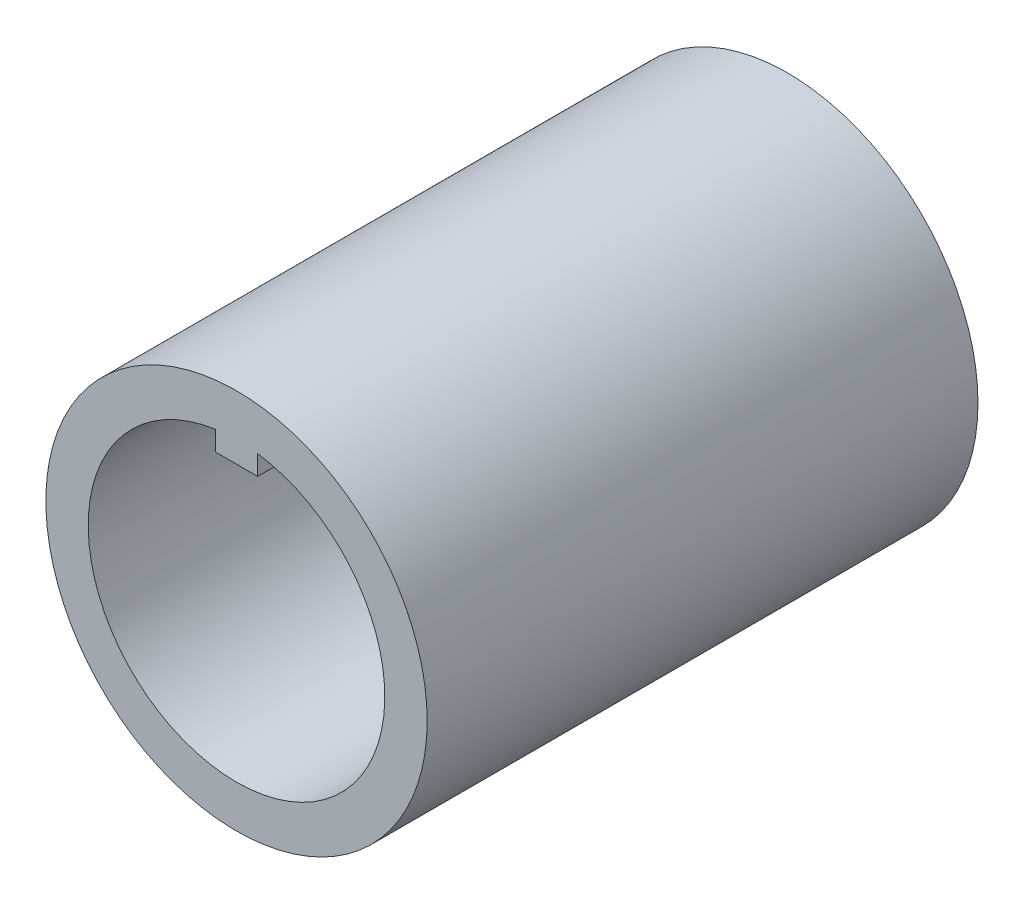
ISO-10303-21;
HEADER;
FILE_DESCRIPTION(('STEP AP214'),'2;1');
FILE_NAME('part.step','',(''),(''),'','','');
FILE_SCHEMA(('AUTOMOTIVE_DESIGN { 1 0 10303 214 1 1 1 1 }'));
ENDSEC;
DATA;
#1=APPLICATION_CONTEXT('core data for automotive mechanical design processes');
#2=APPLICATION_PROTOCOL_DEFINITION('international standard','automotive_design',2000,#1);
#3=PRODUCT_CONTEXT('',#1,'mechanical');
#4=PRODUCT('Part','Part','',(#3));
#5=PRODUCT_RELATED_PRODUCT_CATEGORY('part','',(#4));
#6=PRODUCT_DEFINITION_FORMATION('','',#4);
#7=PRODUCT_DEFINITION_CONTEXT('part definition',#1,'design');
#8=PRODUCT_DEFINITION('design','',#6,#7);
#9=PRODUCT_DEFINITION_SHAPE('','',#8);
#10=(LENGTH_UNIT() NAMED_UNIT(*) SI_UNIT(.MILLI.,.METRE.));
#11=(NAMED_UNIT(*) PLANE_ANGLE_UNIT() SI_UNIT($,.RADIAN.));
#12=(NAMED_UNIT(*) SI_UNIT($,.STERADIAN.) SOLID_ANGLE_UNIT());
#13=UNCERTAINTY_MEASURE_WITH_UNIT(LENGTH_MEASURE(1.E-05),#10,'distance_accuracy_value','');
#14=(GEOMETRIC_REPRESENTATION_CONTEXT(3) GLOBAL_UNCERTAINTY_ASSIGNED_CONTEXT((#13)) GLOBAL_UNIT_ASSIGNED_CONTEXT((#10,
#11,#12)) REPRESENTATION_CONTEXT('',''));
#15=CARTESIAN_POINT('',(0.,0.,0.));
#16=DIRECTION('',(0.,0.,1.));
#17=DIRECTION('',(1.,0.,0.));
#18=AXIS2_PLACEMENT_3D('',#15,#16,#17);
#19=CARTESIAN_POINT('',(0.,0.,-26.));
#20=DIRECTION('',(0.,0.,1.));
#21=DIRECTION('',(-1.,0.,0.));
#22=AXIS2_PLACEMENT_3D('',#19,#20,#21);
#23=CYLINDRICAL_SURFACE('',#22,7.);
#24=CARTESIAN_POINT('',(0.,-7.,-17.));
#25=CARTESIAN_POINT('',(0.160281740269091,-6.9999940839629,-16.9999925304185));
#26=CARTESIAN_POINT('',(0.320833907522427,-6.99443250051265,-16.9870786839034));
#27=CARTESIAN_POINT('',(0.637349314958982,-6.97273920628719,-16.9359176345736));
#28=CARTESIAN_POINT('',(0.793299928144207,-6.95658080950724,-16.8976064709267));
#29=CARTESIAN_POINT('',(1.0955347051483,-6.91541630739345,-16.7973302363749));
#30=CARTESIAN_POINT('',(1.24185033642246,-6.89044089228941,-16.7354471561946));
#31=CARTESIAN_POINT('',(1.5218733278968,-6.83405660276648,-16.5901355814363));
#32=CARTESIAN_POINT('',(1.6555840905338,-6.80264947176647,-16.5067129239082));
#33=CARTESIAN_POINT('',(1.91384144205638,-6.7346782187555,-16.3160723523121));
#34=CARTESIAN_POINT('',(2.03764045493602,-6.69793895962371,-16.2079047401042));
#35=CARTESIAN_POINT('',(2.26599040232609,-6.62417654338771,-15.9728561314992));
#36=CARTESIAN_POINT('',(2.3705306503261,-6.5871532404671,-15.8459648153973));
#37=CARTESIAN_POINT('',(2.56285686126493,-6.51482055271223,-15.5689672772845));
#38=CARTESIAN_POINT('',(2.64946811752635,-6.47970460244925,-15.4179895419707));
#39=CARTESIAN_POINT('',(2.795731994081,-6.41796168635027,-15.101890571811));
#40=CARTESIAN_POINT('',(2.8553992914263,-6.39133010120133,-14.9367770955138));
#41=CARTESIAN_POINT('',(2.94294919918375,-6.35147799087276,-14.6056992616908));
#42=CARTESIAN_POINT('',(2.97227494401777,-6.3376522143554,-14.4401922982206));
#43=CARTESIAN_POINT('',(3.00280607158394,-6.32324849688131,-14.1060740303897));
#44=CARTESIAN_POINT('',(3.00402828615096,-6.32266262625149,-13.9374646447086));
#45=CARTESIAN_POINT('',(2.97939999510613,-6.33429573902539,-13.6167000962815));
#46=CARTESIAN_POINT('',(2.95576113815072,-6.34546870930157,-13.464329376668));
#47=CARTESIAN_POINT('',(2.88580772808799,-6.37758411517576,-13.1659724140987));
#48=CARTESIAN_POINT('',(2.83948852833539,-6.39852855266592,-13.0199874861139));
#49=CARTESIAN_POINT('',(2.7245765907069,-6.44830685655466,-12.7347528485648));
#50=CARTESIAN_POINT('',(2.65551974428426,-6.47730295111391,-12.5957197057819));
#51=CARTESIAN_POINT('',(2.49742304873013,-6.53988493882129,-12.3306536759306));
#52=CARTESIAN_POINT('',(2.40837507480489,-6.57347269593628,-12.2046261050705));
#53=CARTESIAN_POINT('',(2.20343405392229,-6.64512404535213,-11.9572224963786));
#54=CARTESIAN_POINT('',(2.08584728856133,-6.68331855389209,-11.837283270528));
#55=CARTESIAN_POINT('',(1.83187332405076,-6.75734605758523,-11.6183284093441));
#56=CARTESIAN_POINT('',(1.6954812162799,-6.79317843254652,-11.5193182541218));
#57=CARTESIAN_POINT('',(1.40318582301271,-6.8595969368957,-11.342756067193));
#58=CARTESIAN_POINT('',(1.24687114970231,-6.89002455033727,-11.2658209812944));
#59=CARTESIAN_POINT('',(0.921879694158934,-6.94097396260558,-11.1398497623853));
#60=CARTESIAN_POINT('',(0.753210215657664,-6.9615015603998,-11.0907972940223));
#61=CARTESIAN_POINT('',(0.42027623894137,-6.98923526893385,-11.025066139541));
#62=CARTESIAN_POINT('',(0.256457961010924,-6.99723249964589,-11.0064612346856));
#63=CARTESIAN_POINT('',(-0.0721433011185075,-7.00155416651738,-10.9963704235918));
#64=CARTESIAN_POINT('',(-0.236925971900557,-6.99788220531666,-11.0048761474676));
#65=CARTESIAN_POINT('',(-0.553542439626671,-6.9797867632015,-11.0474156320548));
#66=CARTESIAN_POINT('',(-0.705598931504216,-6.96594519473644,-11.0800683214483));
#67=CARTESIAN_POINT('',(-1.00189113639242,-6.92953888009974,-11.1680208942382));
#68=CARTESIAN_POINT('',(-1.14612587370002,-6.90697304848521,-11.2233235957222));
#69=CARTESIAN_POINT('',(-1.42777696523888,-6.85438751513719,-11.3568011595021));
#70=CARTESIAN_POINT('',(-1.56483974951837,-6.82415705388474,-11.4356363302261));
#71=CARTESIAN_POINT('',(-1.82428490564705,-6.75942988391438,-11.6132189444759));
#72=CARTESIAN_POINT('',(-1.94666097512992,-6.72493135648758,-11.7119748880233));
#73=CARTESIAN_POINT('',(-2.18296759532595,-6.65214788697903,-11.9352895878429));
#74=CARTESIAN_POINT('',(-2.29556617553686,-6.61377354998591,-12.0612322100614));
#75=CARTESIAN_POINT('',(-2.49843431443676,-6.53984037690252,-12.3307822986316));
#76=CARTESIAN_POINT('',(-2.58869766421195,-6.50428232556792,-12.4743946603748));
#77=CARTESIAN_POINT('',(-2.74563875632303,-6.43962969285319,-12.7788138529586));
#78=CARTESIAN_POINT('',(-2.81186415020233,-6.41066255987443,-12.93988300905));
#79=CARTESIAN_POINT('',(-2.91565885028324,-6.36413607530145,-13.2725263267395));
#80=CARTESIAN_POINT('',(-2.95325364225748,-6.346566580073,-13.4440909983246));
#81=CARTESIAN_POINT('',(-2.9961194841997,-6.32643481136621,-13.7779911723329));
#82=CARTESIAN_POINT('',(-3.00374693238451,-6.3227792566546,-13.9399592675106));
#83=CARTESIAN_POINT('',(-2.99282649265778,-6.32795618271386,-14.2627897469115));
#84=CARTESIAN_POINT('',(-2.97428322126543,-6.33678646098226,-14.4236523211193));
#85=CARTESIAN_POINT('',(-2.91356431394149,-6.36491653890771,-14.7310416962733));
#86=CARTESIAN_POINT('',(-2.87266975661121,-6.38364713099396,-14.8778787915707));
#87=CARTESIAN_POINT('',(-2.769702223632,-6.42898875831973,-15.1626207660839));
#88=CARTESIAN_POINT('',(-2.70762322652259,-6.45560203384716,-15.3005230924077));
#89=CARTESIAN_POINT('',(-2.55963250501149,-6.5157524732596,-15.5728207086796));
#90=CARTESIAN_POINT('',(-2.47248232196069,-6.5496164957701,-15.7064691536948));
#91=CARTESIAN_POINT('',(-2.2784960092513,-6.61959778926566,-15.9579823612475));
#92=CARTESIAN_POINT('',(-2.17165243666714,-6.6557159087398,-16.0758411270492));
#93=CARTESIAN_POINT('',(-1.93135048700133,-6.72955424641834,-16.3020036355007));
#94=CARTESIAN_POINT('',(-1.79645724733279,-6.76717599448736,-16.4088195655728));
#95=CARTESIAN_POINT('',(-1.50919760355001,-6.83696477009089,-16.5984397600312));
#96=CARTESIAN_POINT('',(-1.35682332068822,-6.86912932173672,-16.6812331375999));
#97=CARTESIAN_POINT('',(-1.11954532843042,-6.91035442086787,-16.7845926909895));
#98=CARTESIAN_POINT('',(-1.03957288024831,-6.92286397965452,-16.8154332908018));
#99=CARTESIAN_POINT('',(-0.876970802782695,-6.94533202163241,-16.8702382020223));
#100=CARTESIAN_POINT('',(-0.794342461515166,-6.95529172101821,-16.8942057922754));
#101=CARTESIAN_POINT('',(-0.627265567421398,-6.97234378079151,-16.9349477172834));
#102=CARTESIAN_POINT('',(-0.542821986677287,-6.97944312738119,-16.9517395843805));
#103=CARTESIAN_POINT('',(-0.372647906839315,-6.99059319635284,-16.9780087142034));
#104=CARTESIAN_POINT('',(-0.286918376030205,-6.99464610559385,-16.9874912240139));
#105=CARTESIAN_POINT('',(-0.167492669563777,-6.99807592564236,-16.9955082749436));
#106=CARTESIAN_POINT('',(-0.134021137958668,-6.99879677015532,-16.9971918541176));
#107=CARTESIAN_POINT('',(-0.0670370145842123,-6.99975942751561,-16.9994385012841));
#108=CARTESIAN_POINT('',(-0.0335244225617064,-7.0000012373944,-17.0000015623327));
#109=CARTESIAN_POINT('',(0.,-7.,-17.));
#110=B_SPLINE_CURVE_WITH_KNOTS('',3,(#24,#25,#26,#27,#28,#29,#30,#31,#32,#33,#34,#35,#36,#37,
#38,#39,#40,#41,#42,#43,#44,#45,#46,#47,#48,#49,#50,#51,#52,#53,#54,#55,#56,#57,#58,#59,#60,#61,
#62,#63,#64,#65,#66,#67,#68,#69,#70,#71,#72,#73,#74,#75,#76,#77,#78,#79,#80,#81,#82,#83,#84,#85,
#86,#87,#88,#89,#90,#91,#92,#93,#94,#95,#96,#97,#98,#99,#100,#101,#102,#103,#104,#105,#106,#107,
#108,#109),.UNSPECIFIED.,.T.,.F.,(4,2,2,2,2,2,2,2,2,2,2,2,2,2,2,2,2,2,2,2,2,2,2,2,2,2,2,2,2,2,2,
2,2,2,2,2,2,2,2,2,2,2,4),(0.,0.480714322748847,0.962643903423341,1.44291226275142,
1.92305060961533,2.42622743558506,2.92968263421741,3.45969560860061,3.98941952228263,
4.492594268281,4.99546764377915,5.45710720323576,5.91884138089948,6.3906540887232,
6.86265889892286,7.37709837725841,7.89167239108963,8.41947244601234,8.94696296364743,
9.43957347502028,9.93203191709569,10.3983119423363,10.8646499992176,11.3455505516221,
11.8266567358409,12.3440285038672,12.8615439335848,13.3883469079738,13.9146803943342,
14.3986848887267,14.882604015318,15.341320451094,15.8001673810816,16.2874475008663,
16.7749121624767,17.3008416934144,17.8270092002163,18.0865840789243,18.3460349177801,
18.6048481685098,18.8634754544625,18.964020720529,19.0645666096629),.UNSPECIFIED.);
#111=CARTESIAN_POINT('',(0.,-7.,-17.));
#112=VERTEX_POINT('',#111);
#113=EDGE_CURVE('E134',#112,#112,#110,.T.);
#114=ORIENTED_EDGE('',*,*,#113,.T.);
#115=EDGE_LOOP('',(#114));
#116=FACE_BOUND('',#115,.T.);
#117=CARTESIAN_POINT('',(0.,0.,0.));
#118=DIRECTION('',(0.,0.,1.));
#119=DIRECTION('',(1.,0.,0.));
#120=AXIS2_PLACEMENT_3D('',#117,#118,#119);
#121=CIRCLE('',#120,7.);
#122=CARTESIAN_POINT('',(-1.,6.92820323027551,0.));
#123=VERTEX_POINT('',#122);
#124=CARTESIAN_POINT('',(1.,6.92820323027551,0.));
#125=VERTEX_POINT('',#124);
#126=EDGE_CURVE('E129',#123,#125,#121,.T.);
#127=ORIENTED_EDGE('',*,*,#126,.T.);
#128=DIRECTION('',(0.,0.,1.));
#129=VECTOR('',#128,1.);
#130=CARTESIAN_POINT('',(1.,6.92820323027551,-26.));
#131=LINE('',#130,#129);
#132=CARTESIAN_POINT('',(1.,6.92820323027551,-26.));
#133=VERTEX_POINT('',#132);
#134=EDGE_CURVE('E128',#133,#125,#131,.T.);
#135=ORIENTED_EDGE('',*,*,#134,.F.);
#136=CARTESIAN_POINT('',(0.,0.,-26.));
#137=DIRECTION('',(0.,0.,1.));
#138=DIRECTION('',(1.,0.,0.));
#139=AXIS2_PLACEMENT_3D('',#136,#137,#138);
#140=CIRCLE('',#139,7.);
#141=CARTESIAN_POINT('',(-1.,6.92820323027551,-26.));
#142=VERTEX_POINT('',#141);
#143=EDGE_CURVE('E115',#142,#133,#140,.T.);
#144=ORIENTED_EDGE('',*,*,#143,.F.);
#145=DIRECTION('',(0.,0.,1.));
#146=VECTOR('',#145,1.);
#147=CARTESIAN_POINT('',(-1.,6.92820323027551,-26.));
#148=LINE('',#147,#146);
#149=EDGE_CURVE('E11',#142,#123,#148,.T.);
#150=ORIENTED_EDGE('',*,*,#149,.T.);
#151=EDGE_LOOP('',(#127,#135,#144,#150));
#152=FACE_BOUND('',#151,.T.);
#153=ADVANCED_FACE('F45',(#116,#152),#23,.F.);
#154=CARTESIAN_POINT('',(-1.,0.,-26.));
#155=DIRECTION('',(1.,0.,0.));
#156=DIRECTION('',(0.,0.,1.));
#157=AXIS2_PLACEMENT_3D('',#154,#155,#156);
#158=PLANE('',#157);
#159=DIRECTION('',(0.,-1.,0.));
#160=VECTOR('',#159,1.);
#161=CARTESIAN_POINT('',(-1.,0.,0.));
#162=LINE('',#161,#160);
#163=CARTESIAN_POINT('',(-1.,6.,0.));
#164=VERTEX_POINT('',#163);
#165=EDGE_CURVE('E133',#123,#164,#162,.T.);
#166=ORIENTED_EDGE('',*,*,#165,.F.);
#167=ORIENTED_EDGE('',*,*,#149,.F.);
#168=DIRECTION('',(0.,-1.,0.));
#169=VECTOR('',#168,1.);
#170=CARTESIAN_POINT('',(-1.,0.,-26.));
#171=LINE('',#170,#169);
#172=CARTESIAN_POINT('',(-1.,6.,-26.));
#173=VERTEX_POINT('',#172);
#174=EDGE_CURVE('E94',#142,#173,#171,.T.);
#175=ORIENTED_EDGE('',*,*,#174,.T.);
#176=DIRECTION('',(0.,0.,1.));
#177=VECTOR('',#176,1.);
#178=CARTESIAN_POINT('',(-1.,6.,-26.));
#179=LINE('',#178,#177);
#180=EDGE_CURVE('E61',#173,#164,#179,.T.);
#181=ORIENTED_EDGE('',*,*,#180,.T.);
#182=EDGE_LOOP('',(#166,#167,#175,#181));
#183=FACE_BOUND('',#182,.T.);
#184=ADVANCED_FACE('F112',(#183),#158,.F.);
#185=CARTESIAN_POINT('',(0.,6.,-26.));
#186=DIRECTION('',(0.,1.,0.));
#187=DIRECTION('',(0.,0.,-1.));
#188=AXIS2_PLACEMENT_3D('',#185,#186,#187);
#189=PLANE('',#188);
#190=DIRECTION('',(1.,0.,0.));
#191=VECTOR('',#190,1.);
#192=CARTESIAN_POINT('',(0.,6.,0.));
#193=LINE('',#192,#191);
#194=CARTESIAN_POINT('',(1.,6.,0.));
#195=VERTEX_POINT('',#194);
#196=EDGE_CURVE('E106',#164,#195,#193,.T.);
#197=ORIENTED_EDGE('',*,*,#196,.F.);
#198=ORIENTED_EDGE('',*,*,#180,.F.);
#199=DIRECTION('',(1.,0.,0.));
#200=VECTOR('',#199,1.);
#201=CARTESIAN_POINT('',(0.,6.,-26.));
#202=LINE('',#201,#200);
#203=CARTESIAN_POINT('',(1.,6.,-26.));
#204=VERTEX_POINT('',#203);
#205=EDGE_CURVE('E97',#173,#204,#202,.T.);
#206=ORIENTED_EDGE('',*,*,#205,.T.);
#207=DIRECTION('',(0.,0.,1.));
#208=VECTOR('',#207,1.);
#209=CARTESIAN_POINT('',(1.,6.,-26.));
#210=LINE('',#209,#208);
#211=EDGE_CURVE('E110',#204,#195,#210,.T.);
#212=ORIENTED_EDGE('',*,*,#211,.T.);
#213=EDGE_LOOP('',(#197,#198,#206,#212));
#214=FACE_BOUND('',#213,.T.);
#215=ADVANCED_FACE('F105',(#214),#189,.F.);
#216=CARTESIAN_POINT('',(1.,0.,-26.));
#217=DIRECTION('',(-1.,0.,0.));
#218=DIRECTION('',(0.,0.,-1.));
#219=AXIS2_PLACEMENT_3D('',#216,#217,#218);
#220=PLANE('',#219);
#221=DIRECTION('',(0.,1.,0.));
#222=VECTOR('',#221,1.);
#223=CARTESIAN_POINT('',(1.,0.,0.));
#224=LINE('',#223,#222);
#225=EDGE_CURVE('E83',#195,#125,#224,.T.);
#226=ORIENTED_EDGE('',*,*,#225,.F.);
#227=ORIENTED_EDGE('',*,*,#211,.F.);
#228=DIRECTION('',(0.,1.,0.));
#229=VECTOR('',#228,1.);
#230=CARTESIAN_POINT('',(1.,0.,-26.));
#231=LINE('',#230,#229);
#232=EDGE_CURVE('E69',#204,#133,#231,.T.);
#233=ORIENTED_EDGE('',*,*,#232,.T.);
#234=ORIENTED_EDGE('',*,*,#134,.T.);
#235=EDGE_LOOP('',(#226,#227,#233,#234));
#236=FACE_BOUND('',#235,.T.);
#237=ADVANCED_FACE('F151',(#236),#220,.F.);
#238=CARTESIAN_POINT('',(0.,0.,-26.));
#239=DIRECTION('',(0.,0.,1.));
#240=DIRECTION('',(-1.,0.,0.));
#241=AXIS2_PLACEMENT_3D('',#238,#239,#240);
#242=CYLINDRICAL_SURFACE('',#241,9.);
#243=CARTESIAN_POINT('',(0.,-9.,-17.));
#244=CARTESIAN_POINT('',(0.163690088660169,-9.00000045902832,-17.0000007611949));
#245=CARTESIAN_POINT('',(0.327375583615649,-8.99549308522634,-16.9865592016183));
#246=CARTESIAN_POINT('',(0.649925282618916,-8.97795630609842,-16.9333126735483));
#247=CARTESIAN_POINT('',(0.808788984356454,-8.96492601606458,-16.8935049681532));
#248=CARTESIAN_POINT('',(1.11699836850533,-8.93175923719328,-16.7890422698479));
#249=CARTESIAN_POINT('',(1.2663594776581,-8.9116346319256,-16.7244288126222));
#250=CARTESIAN_POINT('',(1.55212481041597,-8.86633337152025,-16.572376481485));
#251=CARTESIAN_POINT('',(1.68852647087612,-8.84115572003333,-16.4849331049922));
#252=CARTESIAN_POINT('',(1.9492250250668,-8.78742283329015,-16.2865225854237));
#253=CARTESIAN_POINT('',(2.07301110089493,-8.75878669391354,-16.1749062972185));
#254=CARTESIAN_POINT('',(2.30049807810626,-8.70180944349364,-15.9326985358803));
#255=CARTESIAN_POINT('',(2.40419455646839,-8.67346839871647,-15.8021028952145));
#256=CARTESIAN_POINT('',(2.59147482668358,-8.61939997431822,-15.5210446544106));
#257=CARTESIAN_POINT('',(2.6743945746631,-8.59377117827064,-15.3701187808036));
#258=CARTESIAN_POINT('',(2.81345662163316,-8.54925916255803,-15.0554717166244));
#259=CARTESIAN_POINT('',(2.86960709216029,-8.53037388482237,-14.8917544485118));
#260=CARTESIAN_POINT('',(2.95162038452749,-8.50233909808132,-14.5619803355099));
#261=CARTESIAN_POINT('',(2.97844034481531,-8.49288287308834,-14.3961883745328));
#262=CARTESIAN_POINT('',(3.00402337000343,-8.48386969888523,-14.0622087375324));
#263=CARTESIAN_POINT('',(3.00279510481415,-8.4843096906819,-13.8940218178724));
#264=CARTESIAN_POINT('',(2.97305971111025,-8.49477045024541,-13.5681901086679));
#265=CARTESIAN_POINT('',(2.94580173950098,-8.50435247602599,-13.4104147912429));
#266=CARTESIAN_POINT('',(2.86681848854825,-8.53129973173653,-13.1018197411795));
#267=CARTESIAN_POINT('',(2.81509027977561,-8.54866589352322,-12.9510008436948));
#268=CARTESIAN_POINT('',(2.68781717418063,-8.58953733393746,-12.6577617512256));
#269=CARTESIAN_POINT('',(2.61190214612179,-8.61313697379352,-12.5155159235914));
#270=CARTESIAN_POINT('',(2.43866731890942,-8.66377675727179,-12.2453872751608));
#271=CARTESIAN_POINT('',(2.34134133709201,-8.6908178937139,-12.1175086191999));
#272=CARTESIAN_POINT('',(2.12204799804671,-8.74701987503222,-11.8727252055177));
#273=CARTESIAN_POINT('',(1.99905945022893,-8.77621768064528,-11.7567419164728));
#274=CARTESIAN_POINT('',(1.73501870991019,-8.8322081516111,-11.5468062000098));
#275=CARTESIAN_POINT('',(1.59396478698244,-8.85900058614202,-11.4528558855065));
#276=CARTESIAN_POINT('',(1.2958428391388,-8.90751323813381,-11.2889110992948));
#277=CARTESIAN_POINT('',(1.138629829249,-8.92918050024118,-11.2191635259778));
#278=CARTESIAN_POINT('',(0.813807250093517,-8.96461701433304,-11.1073904781329));
#279=CARTESIAN_POINT('',(0.646201314464859,-8.97838900964638,-11.0653553737297));
#280=CARTESIAN_POINT('',(0.313151488587912,-8.99602881214321,-11.0118330019329));
#281=CARTESIAN_POINT('',(0.147928799594537,-9.00030005501184,-10.9991005724817));
#282=CARTESIAN_POINT('',(-0.182325209880714,-8.99966708084482,-11.0009980207954));
#283=CARTESIAN_POINT('',(-0.347356557958953,-8.99476441258087,-11.0156232799396));
#284=CARTESIAN_POINT('',(-0.667559598912768,-8.97660074151313,-11.0708357232079));
#285=CARTESIAN_POINT('',(-0.822878420504531,-8.96358596133577,-11.1106586181485));
#286=CARTESIAN_POINT('',(-1.12456787573872,-8.9307554049021,-11.2141803334002));
#287=CARTESIAN_POINT('',(-1.27093736552582,-8.91093876140025,-11.2778821984034));
#288=CARTESIAN_POINT('',(-1.55486488917982,-8.86586793861869,-11.4292112955224));
#289=CARTESIAN_POINT('',(-1.69208987765144,-8.84048444267358,-11.5174237798495));
#290=CARTESIAN_POINT('',(-1.95019449040676,-8.78715761748787,-11.7145824500405));
#291=CARTESIAN_POINT('',(-2.07106910338673,-8.75921350781483,-11.8235349680953));
#292=CARTESIAN_POINT('',(-2.2987575234189,-8.70230543941334,-12.0649362530198));
#293=CARTESIAN_POINT('',(-2.40468290773731,-8.67335283262283,-12.1982276807806));
#294=CARTESIAN_POINT('',(-2.59277256697072,-8.61899919884126,-12.4813147034327));
#295=CARTESIAN_POINT('',(-2.67493664379304,-8.59359820146007,-12.6311104359022));
#296=CARTESIAN_POINT('',(-2.81279079124908,-8.54947175374151,-12.9430190458697));
#297=CARTESIAN_POINT('',(-2.86853439649506,-8.53073282378936,-13.1051062375063));
#298=CARTESIAN_POINT('',(-2.95168400027807,-8.50232496919348,-13.4371359501324));
#299=CARTESIAN_POINT('',(-2.97910276486182,-8.49265195870918,-13.607074896213));
#300=CARTESIAN_POINT('',(-3.00382884743203,-8.48393576622532,-13.9405912881227));
#301=CARTESIAN_POINT('',(-3.0026107719252,-8.48437200772245,-14.1040470208605));
#302=CARTESIAN_POINT('',(-2.97372688034608,-8.49453809471602,-14.4282952247662));
#303=CARTESIAN_POINT('',(-2.94606263837576,-8.50426738708084,-14.5890878538653));
#304=CARTESIAN_POINT('',(-2.86611543938804,-8.53153572914675,-14.9004069890074));
#305=CARTESIAN_POINT('',(-2.81431003804655,-8.54892294067433,-15.0510704750135));
#306=CARTESIAN_POINT('',(-2.68793809727924,-8.58949196455406,-15.3416822208148));
#307=CARTESIAN_POINT('',(-2.61336650566142,-8.61267506290179,-15.481628093564));
#308=CARTESIAN_POINT('',(-2.43978207775029,-8.66348487678138,-15.7534510097687));
#309=CARTESIAN_POINT('',(-2.33984472829374,-8.69126134926411,-15.8847095056952));
#310=CARTESIAN_POINT('',(-2.11992864940694,-8.74750068849758,-16.1290694401526));
#311=CARTESIAN_POINT('',(-1.99994425335445,-8.77596374737117,-16.2421657270642));
#312=CARTESIAN_POINT('',(-1.73772467076206,-8.83170091576632,-16.4514332368676));
#313=CARTESIAN_POINT('',(-1.59480454049918,-8.8588854540377,-16.546773043253));
#314=CARTESIAN_POINT('',(-1.29407207221987,-8.90777973517836,-16.7119712865519));
#315=CARTESIAN_POINT('',(-1.13626355439704,-8.9294908772379,-16.7818362377661));
#316=CARTESIAN_POINT('',(-0.817480941602926,-8.96416545205626,-16.891164897466));
#317=CARTESIAN_POINT('',(-0.656963273029224,-8.97747637267568,-16.9318473987901));
#318=CARTESIAN_POINT('',(-0.330961248030739,-8.99539221192665,-16.9862608420314));
#319=CARTESIAN_POINT('',(-0.165478276706238,-8.99999953595715,-16.9999992304896));
#320=CARTESIAN_POINT('',(0.,-9.,-17.));
#321=B_SPLINE_CURVE_WITH_KNOTS('',3,(#243,#244,#245,#246,#247,#248,#249,#250,#251,#252,#253,
#254,#255,#256,#257,#258,#259,#260,#261,#262,#263,#264,#265,#266,#267,#268,#269,#270,#271,#272,
#273,#274,#275,#276,#277,#278,#279,#280,#281,#282,#283,#284,#285,#286,#287,#288,#289,#290,#291,
#292,#293,#294,#295,#296,#297,#298,#299,#300,#301,#302,#303,#304,#305,#306,#307,#308,#309,#310,
#311,#312,#313,#314,#315,#316,#317,#318,#319,#320),.UNSPECIFIED.,.T.,.F.,(4,2,2,2,2,2,2,2,2,2,2,
2,2,2,2,2,2,2,2,2,2,2,2,2,2,2,2,2,2,2,2,2,2,2,2,2,2,2,4),(0.,0.490461318078032,
0.980973555802562,1.47066801861082,1.9604591333973,2.46554052848268,2.97073299862591,
3.49045154470412,4.010011340785,4.5120577722552,5.01394901962456,5.49290479653841,
5.97191792566447,6.45864513465392,6.94551307674621,7.45779917434101,7.97013437899856,
8.48755216951073,9.00479006631625,9.49960749525509,9.9943413949253,10.4747447393464,
10.9552093585231,11.4483119953121,11.9415654246567,12.4572306864226,12.9729002470499,
13.4875204148031,14.0019085411752,14.4898699819277,14.9778023805413,15.4564676124125,
15.9352391452793,16.4349020007541,16.9347063337134,17.453989825053,17.9731404345737,
18.4690967512144,18.9649159811442),.UNSPECIFIED.);
#322=CARTESIAN_POINT('',(0.,-9.,-17.));
#323=VERTEX_POINT('',#322);
#324=EDGE_CURVE('E49',#323,#323,#321,.T.);
#325=ORIENTED_EDGE('',*,*,#324,.F.);
#326=EDGE_LOOP('',(#325));
#327=FACE_BOUND('',#326,.T.);
#328=CARTESIAN_POINT('',(0.,0.,-26.));
#329=DIRECTION('',(0.,0.,1.));
#330=DIRECTION('',(1.,0.,0.));
#331=AXIS2_PLACEMENT_3D('',#328,#329,#330);
#332=CIRCLE('',#331,9.);
#333=CARTESIAN_POINT('',(9.,0.,-26.));
#334=VERTEX_POINT('',#333);
#335=EDGE_CURVE('E124',#334,#334,#332,.T.);
#336=ORIENTED_EDGE('',*,*,#335,.T.);
#337=EDGE_LOOP('',(#336));
#338=FACE_BOUND('',#337,.T.);
#339=CARTESIAN_POINT('',(0.,0.,0.));
#340=DIRECTION('',(0.,0.,1.));
#341=DIRECTION('',(1.,0.,0.));
#342=AXIS2_PLACEMENT_3D('',#339,#340,#341);
#343=CIRCLE('',#342,9.);
#344=CARTESIAN_POINT('',(9.,0.,0.));
#345=VERTEX_POINT('',#344);
#346=EDGE_CURVE('E118',#345,#345,#343,.T.);
#347=ORIENTED_EDGE('',*,*,#346,.F.);
#348=EDGE_LOOP('',(#347));
#349=FACE_BOUND('',#348,.T.);
#350=ADVANCED_FACE('F153',(#327,#338,#349),#242,.T.);
#351=CARTESIAN_POINT('',(0.,0.,-26.));
#352=DIRECTION('',(0.,0.,-1.));
#353=DIRECTION('',(1.,0.,0.));
#354=AXIS2_PLACEMENT_3D('',#351,#352,#353);
#355=PLANE('',#354);
#356=ORIENTED_EDGE('',*,*,#143,.T.);
#357=ORIENTED_EDGE('',*,*,#232,.F.);
#358=ORIENTED_EDGE('',*,*,#205,.F.);
#359=ORIENTED_EDGE('',*,*,#174,.F.);
#360=EDGE_LOOP('',(#356,#357,#358,#359));
#361=FACE_BOUND('',#360,.T.);
#362=ORIENTED_EDGE('',*,*,#335,.F.);
#363=EDGE_LOOP('',(#362));
#364=FACE_BOUND('',#363,.T.);
#365=ADVANCED_FACE('F99',(#361,#364),#355,.T.);
#366=CARTESIAN_POINT('',(0.,0.,0.));
#367=DIRECTION('',(0.,0.,-1.));
#368=DIRECTION('',(1.,0.,0.));
#369=AXIS2_PLACEMENT_3D('',#366,#367,#368);
#370=PLANE('',#369);
#371=ORIENTED_EDGE('',*,*,#126,.F.);
#372=ORIENTED_EDGE('',*,*,#165,.T.);
#373=ORIENTED_EDGE('',*,*,#196,.T.);
#374=ORIENTED_EDGE('',*,*,#225,.T.);
#375=EDGE_LOOP('',(#371,#372,#373,#374));
#376=FACE_BOUND('',#375,.T.);
#377=ORIENTED_EDGE('',*,*,#346,.T.);
#378=EDGE_LOOP('',(#377));
#379=FACE_BOUND('',#378,.T.);
#380=ADVANCED_FACE('F147',(#376,#379),#370,.F.);
#381=CARTESIAN_POINT('',(0.,-10.,-14.));
#382=DIRECTION('',(0.,1.,0.));
#383=DIRECTION('',(0.,0.,-1.));
#384=AXIS2_PLACEMENT_3D('',#381,#382,#383);
#385=CYLINDRICAL_SURFACE('',#384,3.);
#386=ORIENTED_EDGE('',*,*,#113,.F.);
#387=EDGE_LOOP('',(#386));
#388=FACE_BOUND('',#387,.T.);
#389=ORIENTED_EDGE('',*,*,#324,.T.);
#390=EDGE_LOOP('',(#389));
#391=FACE_BOUND('',#390,.T.);
#392=ADVANCED_FACE('F175',(#388,#391),#385,.F.);
#393=CLOSED_SHELL('',(#153,#184,#215,#237,#350,#365,#380,#392));
#394=MANIFOLD_SOLID_BREP('B2',#393);
#395=ADVANCED_BREP_SHAPE_REPRESENTATION('',(#18,#394),#14);
#396=SHAPE_DEFINITION_REPRESENTATION(#9,#395);
ENDSEC;
END-ISO-10303-21;
